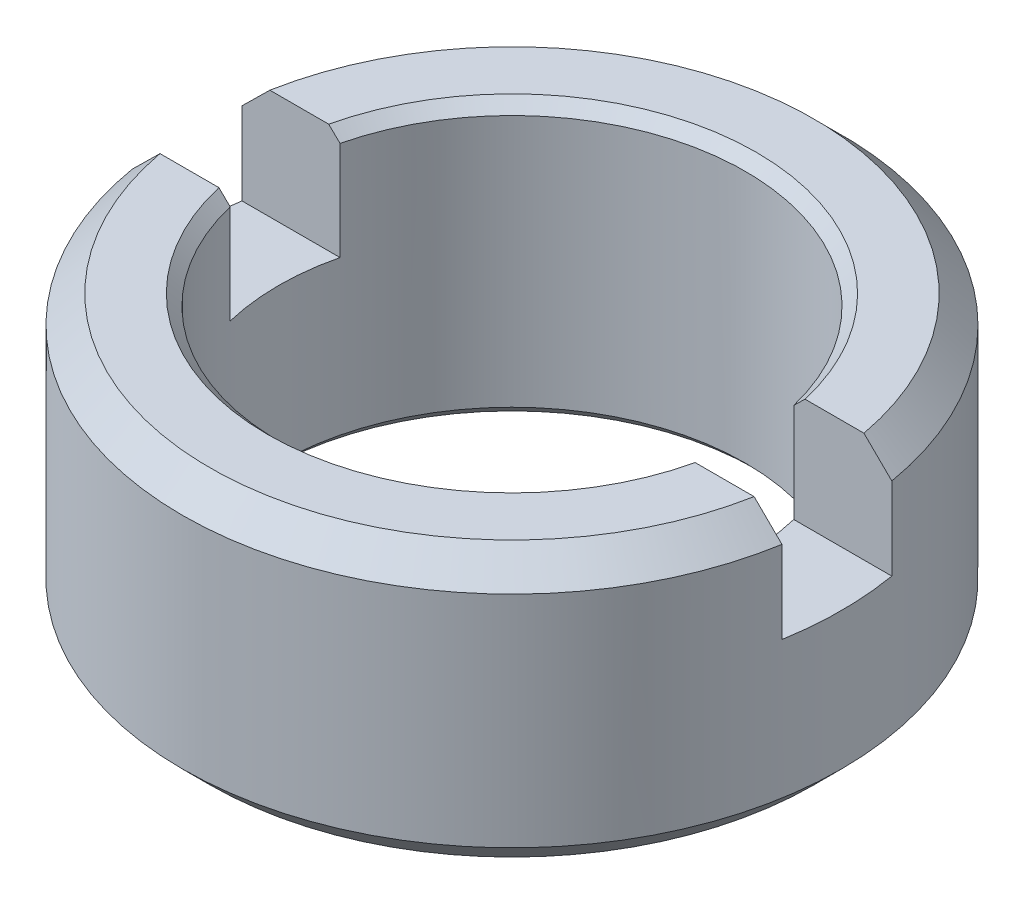
ISO-10303-21;
HEADER;
FILE_DESCRIPTION(('STEP AP214'),'2;1');
FILE_NAME('part.step','',(''),(''),'','','');
FILE_SCHEMA(('AUTOMOTIVE_DESIGN { 1 0 10303 214 1 1 1 1 }'));
ENDSEC;
DATA;
#1=APPLICATION_CONTEXT('core data for automotive mechanical design processes');
#2=APPLICATION_PROTOCOL_DEFINITION('international standard','automotive_design',2000,#1);
#3=PRODUCT_CONTEXT('',#1,'mechanical');
#4=PRODUCT('Part','Part','',(#3));
#5=PRODUCT_RELATED_PRODUCT_CATEGORY('part','',(#4));
#6=PRODUCT_DEFINITION_FORMATION('','',#4);
#7=PRODUCT_DEFINITION_CONTEXT('part definition',#1,'design');
#8=PRODUCT_DEFINITION('design','',#6,#7);
#9=PRODUCT_DEFINITION_SHAPE('','',#8);
#10=(LENGTH_UNIT() NAMED_UNIT(*) SI_UNIT(.MILLI.,.METRE.));
#11=(NAMED_UNIT(*) PLANE_ANGLE_UNIT() SI_UNIT($,.RADIAN.));
#12=(NAMED_UNIT(*) SI_UNIT($,.STERADIAN.) SOLID_ANGLE_UNIT());
#13=UNCERTAINTY_MEASURE_WITH_UNIT(LENGTH_MEASURE(1.E-05),#10,'distance_accuracy_value','');
#14=(GEOMETRIC_REPRESENTATION_CONTEXT(3) GLOBAL_UNCERTAINTY_ASSIGNED_CONTEXT((#13)) GLOBAL_UNIT_ASSIGNED_CONTEXT((#10,
#11,#12)) REPRESENTATION_CONTEXT('',''));
#15=CARTESIAN_POINT('',(0.,0.,0.));
#16=DIRECTION('',(0.,0.,1.));
#17=DIRECTION('',(1.,0.,0.));
#18=AXIS2_PLACEMENT_3D('',#15,#16,#17);
#19=CARTESIAN_POINT('',(0.,3.,0.));
#20=DIRECTION('',(0.,1.,0.));
#21=DIRECTION('',(0.,0.,1.));
#22=AXIS2_PLACEMENT_3D('',#19,#20,#21);
#23=PLANE('',#22);
#24=DIRECTION('',(1.,0.,0.));
#25=VECTOR('',#24,1.);
#26=CARTESIAN_POINT('',(-7.305088277783,3.,1.));
#27=LINE('',#26,#25);
#28=CARTESIAN_POINT('',(4.13067791046459,3.,0.999999999999952));
#29=VERTEX_POINT('',#28);
#30=CARTESIAN_POINT('',(5.91607978309981,3.,1.));
#31=VERTEX_POINT('',#30);
#32=EDGE_CURVE('E94',#29,#31,#27,.T.);
#33=ORIENTED_EDGE('',*,*,#32,.T.);
#34=CARTESIAN_POINT('',(0.,3.,0.));
#35=DIRECTION('',(0.,1.,0.));
#36=DIRECTION('',(0.,0.,1.));
#37=AXIS2_PLACEMENT_3D('',#34,#35,#36);
#38=CIRCLE('',#37,6.);
#39=CARTESIAN_POINT('',(5.91607978309981,3.,-1.));
#40=VERTEX_POINT('',#39);
#41=EDGE_CURVE('E102',#31,#40,#38,.T.);
#42=ORIENTED_EDGE('',*,*,#41,.T.);
#43=DIRECTION('',(-1.,0.,0.));
#44=VECTOR('',#43,1.);
#45=CARTESIAN_POINT('',(7.35821619253,3.,-1.));
#46=LINE('',#45,#44);
#47=CARTESIAN_POINT('',(4.13067791046459,3.,-0.999999999999952));
#48=VERTEX_POINT('',#47);
#49=EDGE_CURVE('E97',#40,#48,#46,.T.);
#50=ORIENTED_EDGE('',*,*,#49,.T.);
#51=CARTESIAN_POINT('',(0.,3.,0.));
#52=DIRECTION('',(0.,1.,0.));
#53=DIRECTION('',(0.,0.,1.));
#54=AXIS2_PLACEMENT_3D('',#51,#52,#53);
#55=CIRCLE('',#54,4.25);
#56=EDGE_CURVE('E19',#48,#29,#55,.F.);
#57=ORIENTED_EDGE('',*,*,#56,.T.);
#58=EDGE_LOOP('',(#33,#42,#50,#57));
#59=FACE_BOUND('',#58,.T.);
#60=ADVANCED_FACE('F16',(#59),#23,.T.);
#61=CARTESIAN_POINT('',(0.,3.,0.));
#62=DIRECTION('',(0.,1.,0.));
#63=DIRECTION('',(0.,0.,1.));
#64=AXIS2_PLACEMENT_3D('',#61,#62,#63);
#65=PLANE('',#64);
#66=DIRECTION('',(-1.,0.,0.));
#67=VECTOR('',#66,1.);
#68=CARTESIAN_POINT('',(7.35821619253,3.,-1.));
#69=LINE('',#68,#67);
#70=CARTESIAN_POINT('',(-4.13067791046459,3.,-0.999999999999952));
#71=VERTEX_POINT('',#70);
#72=CARTESIAN_POINT('',(-5.91607978309981,3.,-1.));
#73=VERTEX_POINT('',#72);
#74=EDGE_CURVE('E146',#71,#73,#69,.T.);
#75=ORIENTED_EDGE('',*,*,#74,.T.);
#76=CARTESIAN_POINT('',(0.,3.,0.));
#77=DIRECTION('',(0.,1.,0.));
#78=DIRECTION('',(0.,0.,1.));
#79=AXIS2_PLACEMENT_3D('',#76,#77,#78);
#80=CIRCLE('',#79,6.);
#81=CARTESIAN_POINT('',(-5.91607978309981,3.,1.));
#82=VERTEX_POINT('',#81);
#83=EDGE_CURVE('E143',#73,#82,#80,.T.);
#84=ORIENTED_EDGE('',*,*,#83,.T.);
#85=DIRECTION('',(1.,0.,0.));
#86=VECTOR('',#85,1.);
#87=CARTESIAN_POINT('',(-7.305088277783,3.,1.));
#88=LINE('',#87,#86);
#89=CARTESIAN_POINT('',(-4.13067791046459,3.,0.999999999999951));
#90=VERTEX_POINT('',#89);
#91=EDGE_CURVE('E175',#82,#90,#88,.T.);
#92=ORIENTED_EDGE('',*,*,#91,.T.);
#93=CARTESIAN_POINT('',(0.,3.,0.));
#94=DIRECTION('',(0.,1.,0.));
#95=DIRECTION('',(0.,0.,1.));
#96=AXIS2_PLACEMENT_3D('',#93,#94,#95);
#97=CIRCLE('',#96,4.25);
#98=EDGE_CURVE('E298',#90,#71,#97,.F.);
#99=ORIENTED_EDGE('',*,*,#98,.T.);
#100=EDGE_LOOP('',(#75,#84,#92,#99));
#101=FACE_BOUND('',#100,.T.);
#102=ADVANCED_FACE('F297',(#101),#65,.T.);
#103=CARTESIAN_POINT('',(7.35821619253,5.,-1.));
#104=DIRECTION('',(0.,0.,-1.));
#105=DIRECTION('',(-1.,0.,0.));
#106=AXIS2_PLACEMENT_3D('',#103,#104,#105);
#107=PLANE('',#106);
#108=DIRECTION('',(0.,1.,0.));
#109=VECTOR('',#108,1.);
#110=CARTESIAN_POINT('',(-5.9160797831,5.,-1.));
#111=LINE('',#110,#109);
#112=CARTESIAN_POINT('',(-5.91607978309981,4.49999999998935,-1.));
#113=VERTEX_POINT('',#112);
#114=EDGE_CURVE('E144',#73,#113,#111,.T.);
#115=ORIENTED_EDGE('',*,*,#114,.F.);
#116=ORIENTED_EDGE('',*,*,#74,.F.);
#117=DIRECTION('',(0.,1.,0.));
#118=VECTOR('',#117,1.);
#119=CARTESIAN_POINT('',(-4.1306779104646,0.,-0.999999999999904));
#120=LINE('',#119,#118);
#121=CARTESIAN_POINT('',(-4.1306779104432,4.8000000000467,-0.999999999999952));
#122=VERTEX_POINT('',#121);
#123=EDGE_CURVE('E129',#71,#122,#120,.T.);
#124=ORIENTED_EDGE('',*,*,#123,.T.);
#125=CARTESIAN_POINT('',(-4.33618495913448,5.0000000000127,-1.));
#126=CARTESIAN_POINT('',(-4.30195516684304,4.96664469558107,-1.));
#127=CARTESIAN_POINT('',(-4.26771468334513,4.9333003767409,-1.));
#128=CARTESIAN_POINT('',(-4.19921233377434,4.86663371008581,-1.));
#129=CARTESIAN_POINT('',(-4.16495046770136,4.833311362271,-1.));
#130=CARTESIAN_POINT('',(-4.13067791042181,4.80000000004774,-1.));
#131=B_SPLINE_CURVE_WITH_KNOTS('',3,(#125,#126,#127,#128,#129,#130),.UNSPECIFIED.,.F.,.F.,(4,2,
4),(0.,0.143381619400022,0.286763239478211),.UNSPECIFIED.);
#132=CARTESIAN_POINT('',(-4.33618495911911,4.99999999999773,-1.));
#133=VERTEX_POINT('',#132);
#134=EDGE_CURVE('E142',#133,#122,#131,.T.);
#135=ORIENTED_EDGE('',*,*,#134,.F.);
#136=DIRECTION('',(-1.,0.,0.));
#137=VECTOR('',#136,1.);
#138=CARTESIAN_POINT('',(7.35821619253,5.,-1.));
#139=LINE('',#138,#137);
#140=CARTESIAN_POINT('',(-5.40832691317048,4.99999999994732,-1.));
#141=VERTEX_POINT('',#140);
#142=EDGE_CURVE('E140',#141,#133,#139,.F.);
#143=ORIENTED_EDGE('',*,*,#142,.F.);
#144=CARTESIAN_POINT('',(-5.91607978309569,4.49999999998295,-1.));
#145=CARTESIAN_POINT('',(-5.8315109142837,4.58339081974542,-1.));
#146=CARTESIAN_POINT('',(-5.74691374092891,4.66675289608223,-1.));
#147=CARTESIAN_POINT('',(-5.57766278428478,4.8334195627405,-1.));
#148=CARTESIAN_POINT('',(-5.49300900099488,4.91672415306139,-1.));
#149=CARTESIAN_POINT('',(-5.40832691316161,4.99999999995603,-1.));
#150=B_SPLINE_CURVE_WITH_KNOTS('',3,(#144,#145,#146,#147,#148,#149),.UNSPECIFIED.,.F.,.F.,(4,2,
4),(0.,0.356305006416172,0.712610016406814),.UNSPECIFIED.);
#151=EDGE_CURVE('E128',#113,#141,#150,.T.);
#152=ORIENTED_EDGE('',*,*,#151,.F.);
#153=EDGE_LOOP('',(#115,#116,#124,#135,#143,#152));
#154=FACE_BOUND('',#153,.T.);
#155=ADVANCED_FACE('F317',(#154),#107,.F.);
#156=CARTESIAN_POINT('',(7.35821619253,5.,-1.));
#157=DIRECTION('',(0.,0.,-1.));
#158=DIRECTION('',(-1.,0.,0.));
#159=AXIS2_PLACEMENT_3D('',#156,#157,#158);
#160=PLANE('',#159);
#161=DIRECTION('',(0.,1.,0.));
#162=VECTOR('',#161,1.);
#163=CARTESIAN_POINT('',(4.1306779104646,0.,-0.999999999999903));
#164=LINE('',#163,#162);
#165=CARTESIAN_POINT('',(4.1306779104432,4.8000000000467,-0.999999999999952));
#166=VERTEX_POINT('',#165);
#167=EDGE_CURVE('E121',#166,#48,#164,.F.);
#168=ORIENTED_EDGE('',*,*,#167,.T.);
#169=ORIENTED_EDGE('',*,*,#49,.F.);
#170=DIRECTION('',(0.,1.,0.));
#171=VECTOR('',#170,1.);
#172=CARTESIAN_POINT('',(5.9160797831,5.,-1.));
#173=LINE('',#172,#171);
#174=CARTESIAN_POINT('',(5.91607978309952,4.49999999998983,-1.));
#175=VERTEX_POINT('',#174);
#176=EDGE_CURVE('E131',#175,#40,#173,.F.);
#177=ORIENTED_EDGE('',*,*,#176,.F.);
#178=CARTESIAN_POINT('',(5.40832691316162,4.99999999995603,-1.));
#179=CARTESIAN_POINT('',(5.49300900099544,4.91672415306084,-1.));
#180=CARTESIAN_POINT('',(5.5776627842859,4.8334195627394,-1.));
#181=CARTESIAN_POINT('',(5.74691374093114,4.66675289608003,-1.));
#182=CARTESIAN_POINT('',(5.83151091428648,4.58339081974268,-1.));
#183=CARTESIAN_POINT('',(5.91607978309903,4.49999999997966,-1.));
#184=B_SPLINE_CURVE_WITH_KNOTS('',3,(#178,#179,#180,#181,#182,#183),.UNSPECIFIED.,.F.,.F.,(4,2,
4),(0.,0.356305009992985,0.7126100164115),.UNSPECIFIED.);
#185=CARTESIAN_POINT('',(5.40832691314812,4.99999999996931,-1.));
#186=VERTEX_POINT('',#185);
#187=EDGE_CURVE('E127',#186,#175,#184,.T.);
#188=ORIENTED_EDGE('',*,*,#187,.F.);
#189=DIRECTION('',(-1.,0.,0.));
#190=VECTOR('',#189,1.);
#191=CARTESIAN_POINT('',(7.35821619253,5.,-1.));
#192=LINE('',#191,#190);
#193=CARTESIAN_POINT('',(4.33618495912563,5.00000000000408,-1.));
#194=VERTEX_POINT('',#193);
#195=EDGE_CURVE('E125',#194,#186,#192,.F.);
#196=ORIENTED_EDGE('',*,*,#195,.F.);
#197=CARTESIAN_POINT('',(4.13067791042181,4.80000000004774,-1.));
#198=CARTESIAN_POINT('',(4.16495046770136,4.833311362271,-1.));
#199=CARTESIAN_POINT('',(4.19921233377434,4.86663371008582,-1.));
#200=CARTESIAN_POINT('',(4.26771468334513,4.93330037674091,-1.));
#201=CARTESIAN_POINT('',(4.30195516684304,4.96664469558108,-1.));
#202=CARTESIAN_POINT('',(4.33618495913448,5.0000000000127,-1.));
#203=B_SPLINE_CURVE_WITH_KNOTS('',3,(#197,#198,#199,#200,#201,#202),.UNSPECIFIED.,.F.,.F.,(4,2,
4),(0.,0.143381620078192,0.286763239478217),.UNSPECIFIED.);
#204=EDGE_CURVE('E134',#166,#194,#203,.T.);
#205=ORIENTED_EDGE('',*,*,#204,.F.);
#206=EDGE_LOOP('',(#168,#169,#177,#188,#196,#205));
#207=FACE_BOUND('',#206,.T.);
#208=ADVANCED_FACE('F199',(#207),#160,.F.);
#209=CARTESIAN_POINT('',(-7.305088277783,5.,1.));
#210=DIRECTION('',(0.,0.,1.));
#211=DIRECTION('',(1.,0.,0.));
#212=AXIS2_PLACEMENT_3D('',#209,#210,#211);
#213=PLANE('',#212);
#214=DIRECTION('',(0.,1.,0.));
#215=VECTOR('',#214,1.);
#216=CARTESIAN_POINT('',(5.9160797831,5.,1.));
#217=LINE('',#216,#215);
#218=CARTESIAN_POINT('',(5.91607978309981,4.49999999998935,1.));
#219=VERTEX_POINT('',#218);
#220=EDGE_CURVE('E109',#31,#219,#217,.T.);
#221=ORIENTED_EDGE('',*,*,#220,.F.);
#222=ORIENTED_EDGE('',*,*,#32,.F.);
#223=DIRECTION('',(0.,1.,0.));
#224=VECTOR('',#223,1.);
#225=CARTESIAN_POINT('',(4.1306779104646,0.,0.999999999999904));
#226=LINE('',#225,#224);
#227=CARTESIAN_POINT('',(4.1306779104432,4.8000000000467,0.999999999999952));
#228=VERTEX_POINT('',#227);
#229=EDGE_CURVE('E105',#29,#228,#226,.T.);
#230=ORIENTED_EDGE('',*,*,#229,.T.);
#231=CARTESIAN_POINT('',(4.33618495913448,5.0000000000127,1.));
#232=CARTESIAN_POINT('',(4.30195516684304,4.96664469558107,1.));
#233=CARTESIAN_POINT('',(4.26771468334513,4.9333003767409,1.));
#234=CARTESIAN_POINT('',(4.19921233377434,4.86663371008581,1.));
#235=CARTESIAN_POINT('',(4.16495046770136,4.833311362271,1.));
#236=CARTESIAN_POINT('',(4.13067791042181,4.80000000004774,1.));
#237=B_SPLINE_CURVE_WITH_KNOTS('',3,(#231,#232,#233,#234,#235,#236),.UNSPECIFIED.,.F.,.F.,(4,2,
4),(0.,0.143381619400022,0.286763239478212),.UNSPECIFIED.);
#238=CARTESIAN_POINT('',(4.33618495911911,4.99999999999773,1.));
#239=VERTEX_POINT('',#238);
#240=EDGE_CURVE('E34',#239,#228,#237,.T.);
#241=ORIENTED_EDGE('',*,*,#240,.F.);
#242=DIRECTION('',(1.,0.,0.));
#243=VECTOR('',#242,1.);
#244=CARTESIAN_POINT('',(-7.305088277783,5.,1.));
#245=LINE('',#244,#243);
#246=CARTESIAN_POINT('',(5.40832691317048,4.99999999994732,1.));
#247=VERTEX_POINT('',#246);
#248=EDGE_CURVE('E212',#247,#239,#245,.F.);
#249=ORIENTED_EDGE('',*,*,#248,.F.);
#250=CARTESIAN_POINT('',(5.91607978309569,4.49999999998295,1.));
#251=CARTESIAN_POINT('',(5.8315109142837,4.58339081974542,1.));
#252=CARTESIAN_POINT('',(5.74691374092891,4.66675289608223,1.));
#253=CARTESIAN_POINT('',(5.57766278428478,4.8334195627405,1.));
#254=CARTESIAN_POINT('',(5.49300900099488,4.91672415306139,1.));
#255=CARTESIAN_POINT('',(5.40832691316161,4.99999999995603,1.));
#256=B_SPLINE_CURVE_WITH_KNOTS('',3,(#250,#251,#252,#253,#254,#255),.UNSPECIFIED.,.F.,.F.,(4,2,
4),(0.,0.356305006416172,0.712610016406814),.UNSPECIFIED.);
#257=EDGE_CURVE('E203',#219,#247,#256,.T.);
#258=ORIENTED_EDGE('',*,*,#257,.F.);
#259=EDGE_LOOP('',(#221,#222,#230,#241,#249,#258));
#260=FACE_BOUND('',#259,.T.);
#261=ADVANCED_FACE('F104',(#260),#213,.F.);
#262=CARTESIAN_POINT('',(-7.305088277783,5.,1.));
#263=DIRECTION('',(0.,0.,1.));
#264=DIRECTION('',(1.,0.,0.));
#265=AXIS2_PLACEMENT_3D('',#262,#263,#264);
#266=PLANE('',#265);
#267=DIRECTION('',(0.,1.,0.));
#268=VECTOR('',#267,1.);
#269=CARTESIAN_POINT('',(-4.1306779104646,0.,0.999999999999903));
#270=LINE('',#269,#268);
#271=CARTESIAN_POINT('',(-4.1306779104432,4.8000000000467,0.999999999999951));
#272=VERTEX_POINT('',#271);
#273=EDGE_CURVE('E114',#272,#90,#270,.F.);
#274=ORIENTED_EDGE('',*,*,#273,.T.);
#275=ORIENTED_EDGE('',*,*,#91,.F.);
#276=DIRECTION('',(0.,1.,0.));
#277=VECTOR('',#276,1.);
#278=CARTESIAN_POINT('',(-5.9160797831,5.,1.));
#279=LINE('',#278,#277);
#280=CARTESIAN_POINT('',(-5.91607978309952,4.49999999998983,1.));
#281=VERTEX_POINT('',#280);
#282=EDGE_CURVE('E275',#281,#82,#279,.F.);
#283=ORIENTED_EDGE('',*,*,#282,.F.);
#284=CARTESIAN_POINT('',(-5.40832691316162,4.99999999995603,1.));
#285=CARTESIAN_POINT('',(-5.49300900099544,4.91672415306084,1.));
#286=CARTESIAN_POINT('',(-5.5776627842859,4.8334195627394,1.));
#287=CARTESIAN_POINT('',(-5.74691374093114,4.66675289608003,1.));
#288=CARTESIAN_POINT('',(-5.83151091428648,4.58339081974268,1.));
#289=CARTESIAN_POINT('',(-5.91607978309903,4.49999999997966,1.));
#290=B_SPLINE_CURVE_WITH_KNOTS('',3,(#284,#285,#286,#287,#288,#289),.UNSPECIFIED.,.F.,.F.,(4,2,
4),(0.,0.356305009992985,0.7126100164115),.UNSPECIFIED.);
#291=CARTESIAN_POINT('',(-5.40832691314812,4.99999999996931,1.));
#292=VERTEX_POINT('',#291);
#293=EDGE_CURVE('E176',#292,#281,#290,.T.);
#294=ORIENTED_EDGE('',*,*,#293,.F.);
#295=DIRECTION('',(1.,0.,0.));
#296=VECTOR('',#295,1.);
#297=CARTESIAN_POINT('',(-7.305088277783,5.,1.));
#298=LINE('',#297,#296);
#299=CARTESIAN_POINT('',(-4.33618495912563,5.00000000000408,1.));
#300=VERTEX_POINT('',#299);
#301=EDGE_CURVE('E271',#300,#292,#298,.F.);
#302=ORIENTED_EDGE('',*,*,#301,.F.);
#303=CARTESIAN_POINT('',(-4.13067791042181,4.80000000004774,1.));
#304=CARTESIAN_POINT('',(-4.16495046770136,4.833311362271,1.));
#305=CARTESIAN_POINT('',(-4.19921233377434,4.86663371008582,1.));
#306=CARTESIAN_POINT('',(-4.26771468334513,4.93330037674091,1.));
#307=CARTESIAN_POINT('',(-4.30195516684304,4.96664469558108,1.));
#308=CARTESIAN_POINT('',(-4.33618495913448,5.0000000000127,1.));
#309=B_SPLINE_CURVE_WITH_KNOTS('',3,(#303,#304,#305,#306,#307,#308),.UNSPECIFIED.,.F.,.F.,(4,2,
4),(0.,0.143381620078192,0.286763239478217),.UNSPECIFIED.);
#310=EDGE_CURVE('E151',#272,#300,#309,.T.);
#311=ORIENTED_EDGE('',*,*,#310,.F.);
#312=EDGE_LOOP('',(#274,#275,#283,#294,#302,#311));
#313=FACE_BOUND('',#312,.T.);
#314=ADVANCED_FACE('F186',(#313),#266,.F.);
#315=CARTESIAN_POINT('',(0.,4.99999999999545,0.));
#316=DIRECTION('',(0.,1.,0.));
#317=DIRECTION('',(0.,0.,1.));
#318=AXIS2_PLACEMENT_3D('',#315,#316,#317);
#319=CONICAL_SURFACE('',#318,4.44999999996298,0.785398163539557);
#320=ORIENTED_EDGE('',*,*,#134,.T.);
#321=CARTESIAN_POINT('',(0.,4.80000000004566,0.));
#322=DIRECTION('',(0.,1.,0.));
#323=DIRECTION('',(0.,0.,-1.));
#324=AXIS2_PLACEMENT_3D('',#321,#322,#323);
#325=CIRCLE('',#324,4.24999999995634);
#326=EDGE_CURVE('E115',#166,#122,#325,.T.);
#327=ORIENTED_EDGE('',*,*,#326,.F.);
#328=ORIENTED_EDGE('',*,*,#204,.T.);
#329=CARTESIAN_POINT('',(0.,4.99999999999545,0.));
#330=DIRECTION('',(0.,1.,0.));
#331=DIRECTION('',(0.,0.,1.));
#332=AXIS2_PLACEMENT_3D('',#329,#330,#331);
#333=CIRCLE('',#332,4.44999999996298);
#334=EDGE_CURVE('E165',#133,#194,#333,.F.);
#335=ORIENTED_EDGE('',*,*,#334,.F.);
#336=EDGE_LOOP('',(#320,#327,#328,#335));
#337=FACE_BOUND('',#336,.T.);
#338=ADVANCED_FACE('F191',(#337),#319,.F.);
#339=CARTESIAN_POINT('',(0.,0.,0.));
#340=DIRECTION('',(0.,1.,0.));
#341=DIRECTION('',(0.,0.,1.));
#342=AXIS2_PLACEMENT_3D('',#339,#340,#341);
#343=CYLINDRICAL_SURFACE('',#342,4.25);
#344=CARTESIAN_POINT('',(0.,0.199999999949796,0.));
#345=DIRECTION('',(0.,-1.,0.));
#346=DIRECTION('',(0.,0.,-1.));
#347=AXIS2_PLACEMENT_3D('',#344,#345,#346);
#348=CIRCLE('',#347,4.25000000001319);
#349=CARTESIAN_POINT('',(0.,0.199999999949796,-4.25000000001319));
#350=VERTEX_POINT('',#349);
#351=EDGE_CURVE('E118',#350,#350,#348,.T.);
#352=ORIENTED_EDGE('',*,*,#351,.T.);
#353=EDGE_LOOP('',(#352));
#354=FACE_BOUND('',#353,.T.);
#355=CARTESIAN_POINT('',(0.,4.80000000004566,0.));
#356=DIRECTION('',(0.,1.,0.));
#357=DIRECTION('',(0.,0.,-1.));
#358=AXIS2_PLACEMENT_3D('',#355,#356,#357);
#359=CIRCLE('',#358,4.24999999995634);
#360=EDGE_CURVE('E113',#272,#228,#359,.T.);
#361=ORIENTED_EDGE('',*,*,#360,.T.);
#362=ORIENTED_EDGE('',*,*,#229,.F.);
#363=ORIENTED_EDGE('',*,*,#56,.F.);
#364=ORIENTED_EDGE('',*,*,#167,.F.);
#365=ORIENTED_EDGE('',*,*,#326,.T.);
#366=ORIENTED_EDGE('',*,*,#123,.F.);
#367=ORIENTED_EDGE('',*,*,#98,.F.);
#368=ORIENTED_EDGE('',*,*,#273,.F.);
#369=EDGE_LOOP('',(#361,#362,#363,#364,#365,#366,#367,#368));
#370=FACE_BOUND('',#369,.T.);
#371=ADVANCED_FACE('F111',(#354,#370),#343,.F.);
#372=CARTESIAN_POINT('',(0.,0.,0.));
#373=DIRECTION('',(0.,-1.,0.));
#374=DIRECTION('',(0.,0.,-1.));
#375=AXIS2_PLACEMENT_3D('',#372,#373,#374);
#376=CONICAL_SURFACE('',#375,4.44999999996298,0.785398163397448);
#377=ORIENTED_EDGE('',*,*,#351,.F.);
#378=EDGE_LOOP('',(#377));
#379=FACE_BOUND('',#378,.T.);
#380=CARTESIAN_POINT('',(0.,-5.6843418860808E-11,0.));
#381=DIRECTION('',(0.,-1.,0.));
#382=DIRECTION('',(0.,0.,-1.));
#383=AXIS2_PLACEMENT_3D('',#380,#381,#382);
#384=CIRCLE('',#383,4.45000000001983);
#385=CARTESIAN_POINT('',(0.,-5.6843418860808E-11,-4.45000000001983));
#386=VERTEX_POINT('',#385);
#387=EDGE_CURVE('E162',#386,#386,#384,.T.);
#388=ORIENTED_EDGE('',*,*,#387,.T.);
#389=EDGE_LOOP('',(#388));
#390=FACE_BOUND('',#389,.T.);
#391=ADVANCED_FACE('F323',(#379,#390),#376,.F.);
#392=CARTESIAN_POINT('',(0.,5.,0.));
#393=DIRECTION('',(0.,1.,0.));
#394=DIRECTION('',(0.,0.,1.));
#395=AXIS2_PLACEMENT_3D('',#392,#393,#394);
#396=PLANE('',#395);
#397=CARTESIAN_POINT('',(0.,4.99999999993861,0.));
#398=DIRECTION('',(0.,-1.,0.));
#399=DIRECTION('',(0.,0.,-1.));
#400=AXIS2_PLACEMENT_3D('',#397,#398,#399);
#401=CIRCLE('',#400,5.49999999998363);
#402=EDGE_CURVE('E159',#141,#186,#401,.T.);
#403=ORIENTED_EDGE('',*,*,#402,.F.);
#404=ORIENTED_EDGE('',*,*,#142,.T.);
#405=ORIENTED_EDGE('',*,*,#334,.T.);
#406=ORIENTED_EDGE('',*,*,#195,.T.);
#407=EDGE_LOOP('',(#403,#404,#405,#406));
#408=FACE_BOUND('',#407,.T.);
#409=ADVANCED_FACE('F241',(#408),#396,.T.);
#410=CARTESIAN_POINT('',(0.,4.99999999999545,0.));
#411=DIRECTION('',(0.,1.,0.));
#412=DIRECTION('',(0.,0.,1.));
#413=AXIS2_PLACEMENT_3D('',#410,#411,#412);
#414=CONICAL_SURFACE('',#413,4.44999999996298,0.785398163539557);
#415=ORIENTED_EDGE('',*,*,#240,.T.);
#416=ORIENTED_EDGE('',*,*,#360,.F.);
#417=ORIENTED_EDGE('',*,*,#310,.T.);
#418=CARTESIAN_POINT('',(0.,4.99999999999545,0.));
#419=DIRECTION('',(0.,1.,0.));
#420=DIRECTION('',(0.,0.,1.));
#421=AXIS2_PLACEMENT_3D('',#418,#419,#420);
#422=CIRCLE('',#421,4.44999999996298);
#423=EDGE_CURVE('E156',#239,#300,#422,.F.);
#424=ORIENTED_EDGE('',*,*,#423,.F.);
#425=EDGE_LOOP('',(#415,#416,#417,#424));
#426=FACE_BOUND('',#425,.T.);
#427=ADVANCED_FACE('F182',(#426),#414,.F.);
#428=CARTESIAN_POINT('',(0.,0.,0.));
#429=DIRECTION('',(0.,1.,0.));
#430=DIRECTION('',(0.,0.,1.));
#431=AXIS2_PLACEMENT_3D('',#428,#429,#430);
#432=PLANE('',#431);
#433=ORIENTED_EDGE('',*,*,#387,.F.);
#434=EDGE_LOOP('',(#433));
#435=FACE_BOUND('',#434,.T.);
#436=CARTESIAN_POINT('',(0.,0.,0.));
#437=DIRECTION('',(0.,1.,0.));
#438=DIRECTION('',(0.,0.,1.));
#439=AXIS2_PLACEMENT_3D('',#436,#437,#438);
#440=CIRCLE('',#439,5.49999999998363);
#441=CARTESIAN_POINT('',(0.,0.,5.49999999998363));
#442=VERTEX_POINT('',#441);
#443=EDGE_CURVE('E139',#442,#442,#440,.T.);
#444=ORIENTED_EDGE('',*,*,#443,.F.);
#445=EDGE_LOOP('',(#444));
#446=FACE_BOUND('',#445,.T.);
#447=ADVANCED_FACE('F231',(#435,#446),#432,.F.);
#448=CARTESIAN_POINT('',(0.,4.49999999995043,0.));
#449=DIRECTION('',(0.,-1.,0.));
#450=DIRECTION('',(0.,0.,-1.));
#451=AXIS2_PLACEMENT_3D('',#448,#449,#450);
#452=CONICAL_SURFACE('',#451,6.00000000002865,0.785398163454292);
#453=CARTESIAN_POINT('',(0.,4.5,0.));
#454=DIRECTION('',(0.,1.,0.));
#455=DIRECTION('',(0.,0.,1.));
#456=AXIS2_PLACEMENT_3D('',#453,#454,#455);
#457=CIRCLE('',#456,6.);
#458=EDGE_CURVE('E135',#113,#175,#457,.F.);
#459=ORIENTED_EDGE('',*,*,#458,.F.);
#460=ORIENTED_EDGE('',*,*,#151,.T.);
#461=ORIENTED_EDGE('',*,*,#402,.T.);
#462=ORIENTED_EDGE('',*,*,#187,.T.);
#463=EDGE_LOOP('',(#459,#460,#461,#462));
#464=FACE_BOUND('',#463,.T.);
#465=ADVANCED_FACE('F226',(#464),#452,.T.);
#466=CARTESIAN_POINT('',(0.,5.,0.));
#467=DIRECTION('',(0.,1.,0.));
#468=DIRECTION('',(0.,0.,1.));
#469=AXIS2_PLACEMENT_3D('',#466,#467,#468);
#470=PLANE('',#469);
#471=ORIENTED_EDGE('',*,*,#423,.T.);
#472=ORIENTED_EDGE('',*,*,#301,.T.);
#473=CARTESIAN_POINT('',(0.,4.99999999993861,0.));
#474=DIRECTION('',(0.,-1.,0.));
#475=DIRECTION('',(0.,0.,-1.));
#476=AXIS2_PLACEMENT_3D('',#473,#474,#475);
#477=CIRCLE('',#476,5.49999999998363);
#478=EDGE_CURVE('E138',#247,#292,#477,.T.);
#479=ORIENTED_EDGE('',*,*,#478,.F.);
#480=ORIENTED_EDGE('',*,*,#248,.T.);
#481=EDGE_LOOP('',(#471,#472,#479,#480));
#482=FACE_BOUND('',#481,.T.);
#483=ADVANCED_FACE('F230',(#482),#470,.T.);
#484=CARTESIAN_POINT('',(0.,0.499999999931333,0.));
#485=DIRECTION('',(0.,1.,0.));
#486=DIRECTION('',(0.,0.,1.));
#487=AXIS2_PLACEMENT_3D('',#484,#485,#486);
#488=CONICAL_SURFACE('',#487,5.99999999991496,0.785398163397448);
#489=CARTESIAN_POINT('',(0.,0.5,0.));
#490=DIRECTION('',(0.,1.,0.));
#491=DIRECTION('',(0.,0.,1.));
#492=AXIS2_PLACEMENT_3D('',#489,#490,#491);
#493=CIRCLE('',#492,6.);
#494=CARTESIAN_POINT('',(0.,0.5,6.));
#495=VERTEX_POINT('',#494);
#496=EDGE_CURVE('E25',#495,#495,#493,.T.);
#497=ORIENTED_EDGE('',*,*,#496,.F.);
#498=EDGE_LOOP('',(#497));
#499=FACE_BOUND('',#498,.T.);
#500=ORIENTED_EDGE('',*,*,#443,.T.);
#501=EDGE_LOOP('',(#500));
#502=FACE_BOUND('',#501,.T.);
#503=ADVANCED_FACE('F252',(#499,#502),#488,.T.);
#504=CARTESIAN_POINT('',(0.,4.49999999995043,0.));
#505=DIRECTION('',(0.,-1.,0.));
#506=DIRECTION('',(0.,0.,-1.));
#507=AXIS2_PLACEMENT_3D('',#504,#505,#506);
#508=CONICAL_SURFACE('',#507,6.00000000002865,0.785398163454292);
#509=CARTESIAN_POINT('',(0.,4.5,0.));
#510=DIRECTION('',(0.,1.,0.));
#511=DIRECTION('',(0.,0.,1.));
#512=AXIS2_PLACEMENT_3D('',#509,#510,#511);
#513=CIRCLE('',#512,6.);
#514=EDGE_CURVE('E11',#219,#281,#513,.F.);
#515=ORIENTED_EDGE('',*,*,#514,.F.);
#516=ORIENTED_EDGE('',*,*,#257,.T.);
#517=ORIENTED_EDGE('',*,*,#478,.T.);
#518=ORIENTED_EDGE('',*,*,#293,.T.);
#519=EDGE_LOOP('',(#515,#516,#517,#518));
#520=FACE_BOUND('',#519,.T.);
#521=ADVANCED_FACE('F246',(#520),#508,.T.);
#522=CARTESIAN_POINT('',(0.,0.,0.));
#523=DIRECTION('',(0.,1.,0.));
#524=DIRECTION('',(0.,0.,1.));
#525=AXIS2_PLACEMENT_3D('',#522,#523,#524);
#526=CYLINDRICAL_SURFACE('',#525,6.);
#527=ORIENTED_EDGE('',*,*,#496,.T.);
#528=EDGE_LOOP('',(#527));
#529=FACE_BOUND('',#528,.T.);
#530=ORIENTED_EDGE('',*,*,#282,.T.);
#531=ORIENTED_EDGE('',*,*,#83,.F.);
#532=ORIENTED_EDGE('',*,*,#114,.T.);
#533=ORIENTED_EDGE('',*,*,#458,.T.);
#534=ORIENTED_EDGE('',*,*,#176,.T.);
#535=ORIENTED_EDGE('',*,*,#41,.F.);
#536=ORIENTED_EDGE('',*,*,#220,.T.);
#537=ORIENTED_EDGE('',*,*,#514,.T.);
#538=EDGE_LOOP('',(#530,#531,#532,#533,#534,#535,#536,#537));
#539=FACE_BOUND('',#538,.T.);
#540=ADVANCED_FACE('F244',(#529,#539),#526,.T.);
#541=CLOSED_SHELL('',(#60,#102,#155,#208,#261,#314,#338,#371,#391,#409,#427,#447,#465,#483,#503,
#521,#540));
#542=MANIFOLD_SOLID_BREP('B1',#541);
#543=ADVANCED_BREP_SHAPE_REPRESENTATION('',(#18,#542),#14);
#544=SHAPE_DEFINITION_REPRESENTATION(#9,#543);
ENDSEC;
END-ISO-10303-21;
